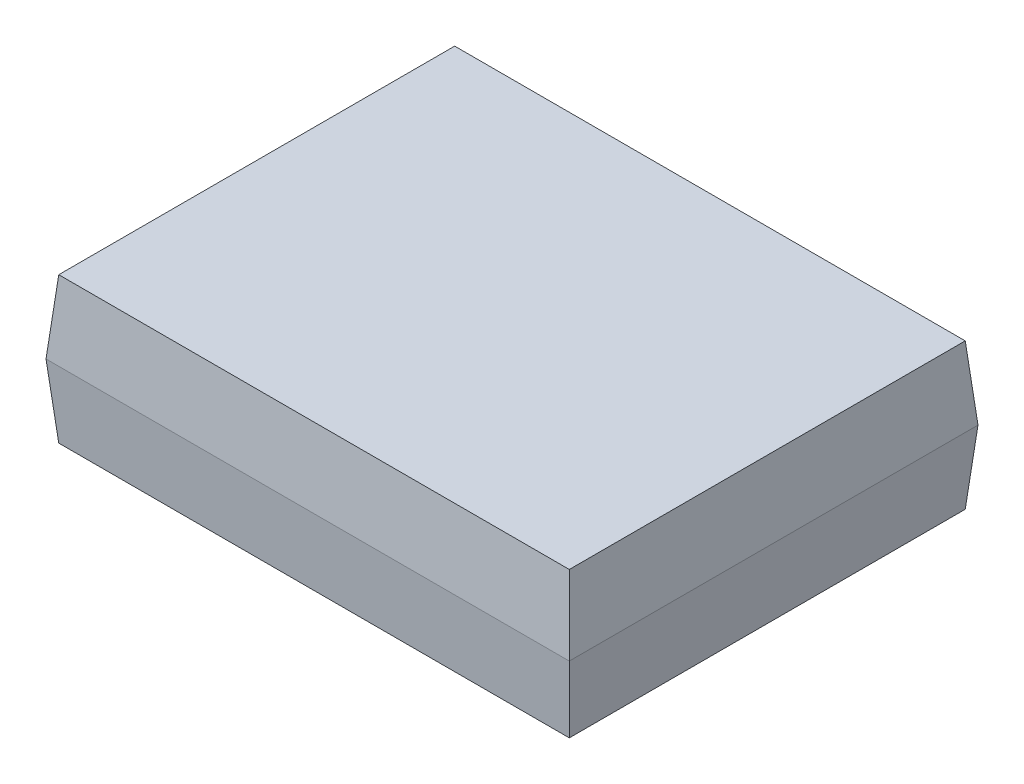
ISO-10303-21;
HEADER;
FILE_DESCRIPTION(('STEP AP214'),'2;1');
FILE_NAME('part.step','',(''),(''),'','','');
FILE_SCHEMA(('AUTOMOTIVE_DESIGN { 1 0 10303 214 1 1 1 1 }'));
ENDSEC;
DATA;
#1=APPLICATION_CONTEXT('core data for automotive mechanical design processes');
#2=APPLICATION_PROTOCOL_DEFINITION('international standard','automotive_design',2000,#1);
#3=PRODUCT_CONTEXT('',#1,'mechanical');
#4=PRODUCT('Part','Part','',(#3));
#5=PRODUCT_RELATED_PRODUCT_CATEGORY('part','',(#4));
#6=PRODUCT_DEFINITION_FORMATION('','',#4);
#7=PRODUCT_DEFINITION_CONTEXT('part definition',#1,'design');
#8=PRODUCT_DEFINITION('design','',#6,#7);
#9=PRODUCT_DEFINITION_SHAPE('','',#8);
#10=(LENGTH_UNIT() NAMED_UNIT(*) SI_UNIT(.MILLI.,.METRE.));
#11=(NAMED_UNIT(*) PLANE_ANGLE_UNIT() SI_UNIT($,.RADIAN.));
#12=(NAMED_UNIT(*) SI_UNIT($,.STERADIAN.) SOLID_ANGLE_UNIT());
#13=UNCERTAINTY_MEASURE_WITH_UNIT(LENGTH_MEASURE(1.E-05),#10,'distance_accuracy_value','');
#14=(GEOMETRIC_REPRESENTATION_CONTEXT(3) GLOBAL_UNCERTAINTY_ASSIGNED_CONTEXT((#13)) GLOBAL_UNIT_ASSIGNED_CONTEXT((#10,
#11,#12)) REPRESENTATION_CONTEXT('',''));
#15=CARTESIAN_POINT('',(0.,0.,0.));
#16=DIRECTION('',(0.,0.,1.));
#17=DIRECTION('',(1.,0.,0.));
#18=AXIS2_PLACEMENT_3D('',#15,#16,#17);
#19=CARTESIAN_POINT('',(0.,0.,0.));
#20=DIRECTION('',(-0.996194698091745,-0.0871557427476582,0.));
#21=DIRECTION('',(0.0871557427476582,-0.996194698091746,0.));
#22=AXIS2_PLACEMENT_3D('',#19,#20,#21);
#23=PLANE('',#22);
#24=DIRECTION('',(0.,0.,1.));
#25=VECTOR('',#24,1.);
#26=CARTESIAN_POINT('',(0.,0.,0.));
#27=LINE('',#26,#25);
#28=CARTESIAN_POINT('',(0.,0.,-3.8));
#29=VERTEX_POINT('',#28);
#30=CARTESIAN_POINT('',(0.,0.,0.));
#31=VERTEX_POINT('',#30);
#32=EDGE_CURVE('E140',#29,#31,#27,.T.);
#33=ORIENTED_EDGE('',*,*,#32,.T.);
#34=DIRECTION('',(0.0868265938642476,-0.992432509138967,-0.0868265938642476));
#35=VECTOR('',#34,1.);
#36=CARTESIAN_POINT('',(0.,0.,0.));
#37=LINE('',#36,#35);
#38=CARTESIAN_POINT('',(-0.0612420644681468,0.7,0.0612420644681468));
#39=VERTEX_POINT('',#38);
#40=EDGE_CURVE('E11',#39,#31,#37,.T.);
#41=ORIENTED_EDGE('',*,*,#40,.F.);
#42=DIRECTION('',(0.,0.,-1.));
#43=VECTOR('',#42,1.);
#44=CARTESIAN_POINT('',(-0.0612420644681468,0.7,0.));
#45=LINE('',#44,#43);
#46=CARTESIAN_POINT('',(-0.0612420644681468,0.7,-3.86124206446815));
#47=VERTEX_POINT('',#46);
#48=EDGE_CURVE('E94',#47,#39,#45,.F.);
#49=ORIENTED_EDGE('',*,*,#48,.F.);
#50=DIRECTION('',(0.0868265938642476,-0.992432509138967,0.0868265938642476));
#51=VECTOR('',#50,1.);
#52=CARTESIAN_POINT('',(0.0286476581278546,-0.327444230753004,-3.77135234187215));
#53=LINE('',#52,#51);
#54=EDGE_CURVE('E97',#47,#29,#53,.T.);
#55=ORIENTED_EDGE('',*,*,#54,.T.);
#56=EDGE_LOOP('',(#33,#41,#49,#55));
#57=FACE_BOUND('',#56,.T.);
#58=ADVANCED_FACE('F39',(#57),#23,.T.);
#59=CARTESIAN_POINT('',(0.,0.,0.));
#60=DIRECTION('',(0.,-0.0871557427476582,0.996194698091746));
#61=DIRECTION('',(0.,-0.996194698091746,-0.0871557427476582));
#62=AXIS2_PLACEMENT_3D('',#59,#60,#61);
#63=PLANE('',#62);
#64=DIRECTION('',(1.,0.,0.));
#65=VECTOR('',#64,1.);
#66=CARTESIAN_POINT('',(0.,0.,0.));
#67=LINE('',#66,#65);
#68=CARTESIAN_POINT('',(4.9,0.,0.));
#69=VERTEX_POINT('',#68);
#70=EDGE_CURVE('E142',#31,#69,#67,.T.);
#71=ORIENTED_EDGE('',*,*,#70,.T.);
#72=DIRECTION('',(-0.0868265938642476,-0.992432509138967,-0.0868265938642476));
#73=VECTOR('',#72,1.);
#74=CARTESIAN_POINT('',(4.9,0.,0.));
#75=LINE('',#74,#73);
#76=CARTESIAN_POINT('',(4.96124206446815,0.7,0.0612420644681468));
#77=VERTEX_POINT('',#76);
#78=EDGE_CURVE('E48',#77,#69,#75,.T.);
#79=ORIENTED_EDGE('',*,*,#78,.F.);
#80=DIRECTION('',(-1.,0.,0.));
#81=VECTOR('',#80,1.);
#82=CARTESIAN_POINT('',(0.,0.7,0.0612420644681468));
#83=LINE('',#82,#81);
#84=EDGE_CURVE('E103',#39,#77,#83,.F.);
#85=ORIENTED_EDGE('',*,*,#84,.F.);
#86=ORIENTED_EDGE('',*,*,#40,.T.);
#87=EDGE_LOOP('',(#71,#79,#85,#86));
#88=FACE_BOUND('',#87,.T.);
#89=ADVANCED_FACE('F41',(#88),#63,.T.);
#90=CARTESIAN_POINT('',(4.9,0.,0.));
#91=DIRECTION('',(0.996194698091745,-0.0871557427476582,0.));
#92=DIRECTION('',(0.0871557427476582,0.996194698091746,0.));
#93=AXIS2_PLACEMENT_3D('',#90,#91,#92);
#94=PLANE('',#93);
#95=DIRECTION('',(0.,0.,-1.));
#96=VECTOR('',#95,1.);
#97=CARTESIAN_POINT('',(4.9,0.,0.));
#98=LINE('',#97,#96);
#99=CARTESIAN_POINT('',(4.9,0.,-3.8));
#100=VERTEX_POINT('',#99);
#101=EDGE_CURVE('E144',#69,#100,#98,.T.);
#102=ORIENTED_EDGE('',*,*,#101,.T.);
#103=DIRECTION('',(-0.0868265938642476,-0.992432509138967,0.0868265938642476));
#104=VECTOR('',#103,1.);
#105=CARTESIAN_POINT('',(4.86305959872987,-0.422230718602558,-3.76305959872987));
#106=LINE('',#105,#104);
#107=CARTESIAN_POINT('',(4.96124206446815,0.7,-3.86124206446815));
#108=VERTEX_POINT('',#107);
#109=EDGE_CURVE('E56',#108,#100,#106,.T.);
#110=ORIENTED_EDGE('',*,*,#109,.F.);
#111=DIRECTION('',(0.,0.,1.));
#112=VECTOR('',#111,1.);
#113=CARTESIAN_POINT('',(4.96124206446815,0.7,0.));
#114=LINE('',#113,#112);
#115=EDGE_CURVE('E121',#77,#108,#114,.F.);
#116=ORIENTED_EDGE('',*,*,#115,.F.);
#117=ORIENTED_EDGE('',*,*,#78,.T.);
#118=EDGE_LOOP('',(#102,#110,#116,#117));
#119=FACE_BOUND('',#118,.T.);
#120=ADVANCED_FACE('F154',(#119),#94,.T.);
#121=CARTESIAN_POINT('',(0.,0.,-3.8));
#122=DIRECTION('',(0.,-0.0871557427476582,-0.996194698091746));
#123=DIRECTION('',(0.,0.996194698091746,-0.0871557427476582));
#124=AXIS2_PLACEMENT_3D('',#121,#122,#123);
#125=PLANE('',#124);
#126=DIRECTION('',(-1.,0.,0.));
#127=VECTOR('',#126,1.);
#128=CARTESIAN_POINT('',(0.,0.,-3.8));
#129=LINE('',#128,#127);
#130=EDGE_CURVE('E104',#100,#29,#129,.T.);
#131=ORIENTED_EDGE('',*,*,#130,.T.);
#132=ORIENTED_EDGE('',*,*,#54,.F.);
#133=DIRECTION('',(1.,0.,0.));
#134=VECTOR('',#133,1.);
#135=CARTESIAN_POINT('',(0.,0.7,-3.86124206446815));
#136=LINE('',#135,#134);
#137=EDGE_CURVE('E43',#108,#47,#136,.F.);
#138=ORIENTED_EDGE('',*,*,#137,.F.);
#139=ORIENTED_EDGE('',*,*,#109,.T.);
#140=EDGE_LOOP('',(#131,#132,#138,#139));
#141=FACE_BOUND('',#140,.T.);
#142=ADVANCED_FACE('F108',(#141),#125,.T.);
#143=CARTESIAN_POINT('',(0.,0.,0.));
#144=DIRECTION('',(0.,-1.,0.));
#145=DIRECTION('',(0.,0.,-1.));
#146=AXIS2_PLACEMENT_3D('',#143,#144,#145);
#147=PLANE('',#146);
#148=ORIENTED_EDGE('',*,*,#32,.F.);
#149=ORIENTED_EDGE('',*,*,#130,.F.);
#150=ORIENTED_EDGE('',*,*,#101,.F.);
#151=ORIENTED_EDGE('',*,*,#70,.F.);
#152=EDGE_LOOP('',(#148,#149,#150,#151));
#153=FACE_BOUND('',#152,.T.);
#154=ADVANCED_FACE('F159',(#153),#147,.T.);
#155=CARTESIAN_POINT('',(-0.0612420644681468,0.7,-3.86124206446815));
#156=DIRECTION('',(-0.996194698091746,0.0871557427476582,0.));
#157=DIRECTION('',(-0.0871557427476582,-0.996194698091746,0.));
#158=AXIS2_PLACEMENT_3D('',#155,#156,#157);
#159=PLANE('',#158);
#160=ORIENTED_EDGE('',*,*,#48,.T.);
#161=DIRECTION('',(-0.0868265938642476,-0.992432509138967,0.0868265938642476));
#162=VECTOR('',#161,1.);
#163=CARTESIAN_POINT('',(-0.0612420644681468,0.7,0.0612420644681468));
#164=LINE('',#163,#162);
#165=CARTESIAN_POINT('',(0.,1.4,0.));
#166=VERTEX_POINT('',#165);
#167=EDGE_CURVE('E132',#166,#39,#164,.T.);
#168=ORIENTED_EDGE('',*,*,#167,.F.);
#169=DIRECTION('',(0.,0.,-1.));
#170=VECTOR('',#169,1.);
#171=CARTESIAN_POINT('',(0.,1.4,-3.86124206446815));
#172=LINE('',#171,#170);
#173=CARTESIAN_POINT('',(0.,1.4,-3.8));
#174=VERTEX_POINT('',#173);
#175=EDGE_CURVE('E124',#174,#166,#172,.F.);
#176=ORIENTED_EDGE('',*,*,#175,.F.);
#177=DIRECTION('',(-0.0868265938642476,-0.992432509138967,-0.0868265938642476));
#178=VECTOR('',#177,1.);
#179=CARTESIAN_POINT('',(-0.0612420644681468,0.7,-3.86124206446815));
#180=LINE('',#179,#178);
#181=EDGE_CURVE('E117',#174,#47,#180,.T.);
#182=ORIENTED_EDGE('',*,*,#181,.T.);
#183=EDGE_LOOP('',(#160,#168,#176,#182));
#184=FACE_BOUND('',#183,.T.);
#185=ADVANCED_FACE('F122',(#184),#159,.T.);
#186=CARTESIAN_POINT('',(-0.0612420644681468,0.7,0.0612420644681468));
#187=DIRECTION('',(0.,0.0871557427476582,0.996194698091746));
#188=DIRECTION('',(0.,-0.996194698091746,0.0871557427476582));
#189=AXIS2_PLACEMENT_3D('',#186,#187,#188);
#190=PLANE('',#189);
#191=ORIENTED_EDGE('',*,*,#84,.T.);
#192=DIRECTION('',(0.0868265938642476,-0.992432509138967,0.0868265938642476));
#193=VECTOR('',#192,1.);
#194=CARTESIAN_POINT('',(4.93167101595823,1.0379986311159,0.0316710159582248));
#195=LINE('',#194,#193);
#196=CARTESIAN_POINT('',(4.9,1.4,0.));
#197=VERTEX_POINT('',#196);
#198=EDGE_CURVE('E127',#197,#77,#195,.T.);
#199=ORIENTED_EDGE('',*,*,#198,.F.);
#200=DIRECTION('',(-1.,0.,0.));
#201=VECTOR('',#200,1.);
#202=CARTESIAN_POINT('',(-0.0612420644681468,1.4,0.));
#203=LINE('',#202,#201);
#204=EDGE_CURVE('E137',#166,#197,#203,.F.);
#205=ORIENTED_EDGE('',*,*,#204,.F.);
#206=ORIENTED_EDGE('',*,*,#167,.T.);
#207=EDGE_LOOP('',(#191,#199,#205,#206));
#208=FACE_BOUND('',#207,.T.);
#209=ADVANCED_FACE('F157',(#208),#190,.T.);
#210=CARTESIAN_POINT('',(4.96124206446815,0.7,-3.86124206446815));
#211=DIRECTION('',(0.996194698091746,0.0871557427476582,0.));
#212=DIRECTION('',(-0.0871557427476582,0.996194698091746,0.));
#213=AXIS2_PLACEMENT_3D('',#210,#211,#212);
#214=PLANE('',#213);
#215=ORIENTED_EDGE('',*,*,#115,.T.);
#216=DIRECTION('',(0.0868265938642476,-0.992432509138967,-0.0868265938642476));
#217=VECTOR('',#216,1.);
#218=CARTESIAN_POINT('',(4.92337827281595,1.13278511896545,-3.82337827281595));
#219=LINE('',#218,#217);
#220=CARTESIAN_POINT('',(4.9,1.4,-3.8));
#221=VERTEX_POINT('',#220);
#222=EDGE_CURVE('E120',#221,#108,#219,.T.);
#223=ORIENTED_EDGE('',*,*,#222,.F.);
#224=DIRECTION('',(0.,0.,1.));
#225=VECTOR('',#224,1.);
#226=CARTESIAN_POINT('',(4.9,1.4,-3.86124206446815));
#227=LINE('',#226,#225);
#228=EDGE_CURVE('E129',#197,#221,#227,.F.);
#229=ORIENTED_EDGE('',*,*,#228,.F.);
#230=ORIENTED_EDGE('',*,*,#198,.T.);
#231=EDGE_LOOP('',(#215,#223,#229,#230));
#232=FACE_BOUND('',#231,.T.);
#233=ADVANCED_FACE('F151',(#232),#214,.T.);
#234=CARTESIAN_POINT('',(-0.0612420644681468,0.7,-3.86124206446815));
#235=DIRECTION('',(0.,0.0871557427476582,-0.996194698091746));
#236=DIRECTION('',(0.,0.996194698091746,0.0871557427476582));
#237=AXIS2_PLACEMENT_3D('',#234,#235,#236);
#238=PLANE('',#237);
#239=ORIENTED_EDGE('',*,*,#137,.T.);
#240=ORIENTED_EDGE('',*,*,#181,.F.);
#241=DIRECTION('',(1.,0.,0.));
#242=VECTOR('',#241,1.);
#243=CARTESIAN_POINT('',(-0.0612420644681468,1.4,-3.8));
#244=LINE('',#243,#242);
#245=EDGE_CURVE('E125',#221,#174,#244,.F.);
#246=ORIENTED_EDGE('',*,*,#245,.F.);
#247=ORIENTED_EDGE('',*,*,#222,.T.);
#248=EDGE_LOOP('',(#239,#240,#246,#247));
#249=FACE_BOUND('',#248,.T.);
#250=ADVANCED_FACE('F115',(#249),#238,.T.);
#251=CARTESIAN_POINT('',(0.,1.4,0.));
#252=DIRECTION('',(0.,1.,0.));
#253=DIRECTION('',(0.,0.,1.));
#254=AXIS2_PLACEMENT_3D('',#251,#252,#253);
#255=PLANE('',#254);
#256=ORIENTED_EDGE('',*,*,#175,.T.);
#257=ORIENTED_EDGE('',*,*,#204,.T.);
#258=ORIENTED_EDGE('',*,*,#228,.T.);
#259=ORIENTED_EDGE('',*,*,#245,.T.);
#260=EDGE_LOOP('',(#256,#257,#258,#259));
#261=FACE_BOUND('',#260,.T.);
#262=ADVANCED_FACE('F236',(#261),#255,.T.);
#263=CLOSED_SHELL('',(#58,#89,#120,#142,#154,#185,#209,#233,#250,#262));
#264=MANIFOLD_SOLID_BREP('B2',#263);
#265=ADVANCED_BREP_SHAPE_REPRESENTATION('',(#18,#264),#14);
#266=SHAPE_DEFINITION_REPRESENTATION(#9,#265);
ENDSEC;
END-ISO-10303-21;
